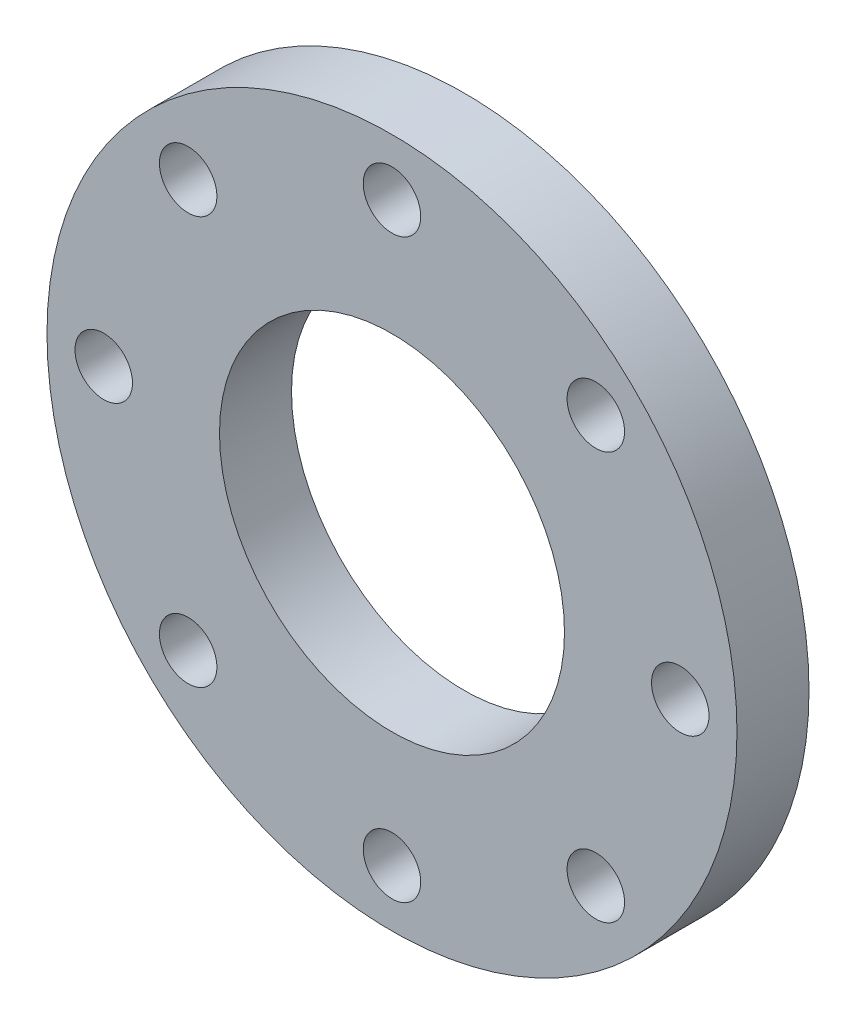
ISO-10303-21;
HEADER;
FILE_DESCRIPTION(('STEP AP214'),'2;1');
FILE_NAME('part.step','',(''),(''),'','','');
FILE_SCHEMA(('AUTOMOTIVE_DESIGN { 1 0 10303 214 1 1 1 1 }'));
ENDSEC;
DATA;
#1=APPLICATION_CONTEXT('core data for automotive mechanical design processes');
#2=APPLICATION_PROTOCOL_DEFINITION('international standard','automotive_design',2000,#1);
#3=PRODUCT_CONTEXT('',#1,'mechanical');
#4=PRODUCT('Part','Part','',(#3));
#5=PRODUCT_RELATED_PRODUCT_CATEGORY('part','',(#4));
#6=PRODUCT_DEFINITION_FORMATION('','',#4);
#7=PRODUCT_DEFINITION_CONTEXT('part definition',#1,'design');
#8=PRODUCT_DEFINITION('design','',#6,#7);
#9=PRODUCT_DEFINITION_SHAPE('','',#8);
#10=(LENGTH_UNIT() NAMED_UNIT(*) SI_UNIT(.MILLI.,.METRE.));
#11=(NAMED_UNIT(*) PLANE_ANGLE_UNIT() SI_UNIT($,.RADIAN.));
#12=(NAMED_UNIT(*) SI_UNIT($,.STERADIAN.) SOLID_ANGLE_UNIT());
#13=UNCERTAINTY_MEASURE_WITH_UNIT(LENGTH_MEASURE(1.E-05),#10,'distance_accuracy_value','');
#14=(GEOMETRIC_REPRESENTATION_CONTEXT(3) GLOBAL_UNCERTAINTY_ASSIGNED_CONTEXT((#13)) GLOBAL_UNIT_ASSIGNED_CONTEXT((#10,
#11,#12)) REPRESENTATION_CONTEXT('',''));
#15=CARTESIAN_POINT('',(0.,0.,0.));
#16=DIRECTION('',(0.,0.,1.));
#17=DIRECTION('',(1.,0.,0.));
#18=AXIS2_PLACEMENT_3D('',#15,#16,#17);
#19=CARTESIAN_POINT('',(0.,0.,23.8));
#20=DIRECTION('',(0.,0.,1.));
#21=DIRECTION('',(1.,0.,0.));
#22=AXIS2_PLACEMENT_3D('',#19,#20,#21);
#23=PLANE('',#22);
#24=CARTESIAN_POINT('',(-95.25,0.,23.8));
#25=DIRECTION('',(0.,0.,1.));
#26=DIRECTION('',(1.,0.,0.));
#27=AXIS2_PLACEMENT_3D('',#24,#25,#26);
#28=CIRCLE('',#27,9.49999999999999);
#29=CARTESIAN_POINT('',(-85.75,0.,23.8));
#30=VERTEX_POINT('',#29);
#31=EDGE_CURVE('E86',#30,#30,#28,.T.);
#32=ORIENTED_EDGE('',*,*,#31,.F.);
#33=EDGE_LOOP('',(#32));
#34=FACE_BOUND('',#33,.T.);
#35=CARTESIAN_POINT('',(0.,-95.25,23.8));
#36=DIRECTION('',(0.,0.,1.));
#37=DIRECTION('',(1.,0.,0.));
#38=AXIS2_PLACEMENT_3D('',#35,#36,#37);
#39=CIRCLE('',#38,9.49999999999999);
#40=CARTESIAN_POINT('',(9.50000000000001,-95.25,23.8));
#41=VERTEX_POINT('',#40);
#42=EDGE_CURVE('E74',#41,#41,#39,.T.);
#43=ORIENTED_EDGE('',*,*,#42,.F.);
#44=EDGE_LOOP('',(#43));
#45=FACE_BOUND('',#44,.T.);
#46=CARTESIAN_POINT('',(95.25,0.,23.8));
#47=DIRECTION('',(0.,0.,1.));
#48=DIRECTION('',(1.,0.,0.));
#49=AXIS2_PLACEMENT_3D('',#46,#47,#48);
#50=CIRCLE('',#49,9.49999999999999);
#51=CARTESIAN_POINT('',(104.75,0.,23.8));
#52=VERTEX_POINT('',#51);
#53=EDGE_CURVE('E62',#52,#52,#50,.T.);
#54=ORIENTED_EDGE('',*,*,#53,.F.);
#55=EDGE_LOOP('',(#54));
#56=FACE_BOUND('',#55,.T.);
#57=CARTESIAN_POINT('',(0.,95.25,23.8));
#58=DIRECTION('',(0.,0.,1.));
#59=DIRECTION('',(1.,0.,0.));
#60=AXIS2_PLACEMENT_3D('',#57,#58,#59);
#61=CIRCLE('',#60,9.5);
#62=CARTESIAN_POINT('',(9.5,95.25,23.8));
#63=VERTEX_POINT('',#62);
#64=EDGE_CURVE('E50',#63,#63,#61,.T.);
#65=ORIENTED_EDGE('',*,*,#64,.F.);
#66=EDGE_LOOP('',(#65));
#67=FACE_BOUND('',#66,.T.);
#68=CARTESIAN_POINT('',(0.,0.,23.8));
#69=DIRECTION('',(0.,0.,1.));
#70=DIRECTION('',(1.,0.,0.));
#71=AXIS2_PLACEMENT_3D('',#68,#69,#70);
#72=CIRCLE('',#71,114.);
#73=CARTESIAN_POINT('',(114.,0.,23.8));
#74=VERTEX_POINT('',#73);
#75=EDGE_CURVE('E10',#74,#74,#72,.T.);
#76=ORIENTED_EDGE('',*,*,#75,.T.);
#77=EDGE_LOOP('',(#76));
#78=FACE_BOUND('',#77,.T.);
#79=CARTESIAN_POINT('',(0.,0.,23.8));
#80=DIRECTION('',(0.,0.,1.));
#81=DIRECTION('',(1.,0.,0.));
#82=AXIS2_PLACEMENT_3D('',#79,#80,#81);
#83=CIRCLE('',#82,57.);
#84=CARTESIAN_POINT('',(57.,0.,23.8));
#85=VERTEX_POINT('',#84);
#86=EDGE_CURVE('E45',#85,#85,#83,.T.);
#87=ORIENTED_EDGE('',*,*,#86,.F.);
#88=EDGE_LOOP('',(#87));
#89=FACE_BOUND('',#88,.T.);
#90=CARTESIAN_POINT('',(67.3519209080186,67.3519209080186,23.8));
#91=DIRECTION('',(0.,0.,1.));
#92=DIRECTION('',(1.,0.,0.));
#93=AXIS2_PLACEMENT_3D('',#90,#91,#92);
#94=CIRCLE('',#93,9.50000000000001);
#95=CARTESIAN_POINT('',(76.8519209080187,67.3519209080186,23.8));
#96=VERTEX_POINT('',#95);
#97=EDGE_CURVE('E56',#96,#96,#94,.T.);
#98=ORIENTED_EDGE('',*,*,#97,.F.);
#99=EDGE_LOOP('',(#98));
#100=FACE_BOUND('',#99,.T.);
#101=CARTESIAN_POINT('',(67.3519209080186,-67.3519209080186,23.8));
#102=DIRECTION('',(0.,0.,1.));
#103=DIRECTION('',(1.,0.,0.));
#104=AXIS2_PLACEMENT_3D('',#101,#102,#103);
#105=CIRCLE('',#104,9.49999999999999);
#106=CARTESIAN_POINT('',(76.8519209080186,-67.3519209080186,23.8));
#107=VERTEX_POINT('',#106);
#108=EDGE_CURVE('E68',#107,#107,#105,.T.);
#109=ORIENTED_EDGE('',*,*,#108,.F.);
#110=EDGE_LOOP('',(#109));
#111=FACE_BOUND('',#110,.T.);
#112=CARTESIAN_POINT('',(-67.3519209080186,-67.3519209080186,23.8));
#113=DIRECTION('',(0.,0.,1.));
#114=DIRECTION('',(1.,0.,0.));
#115=AXIS2_PLACEMENT_3D('',#112,#113,#114);
#116=CIRCLE('',#115,9.50000000000001);
#117=CARTESIAN_POINT('',(-57.8519209080186,-67.3519209080186,23.8));
#118=VERTEX_POINT('',#117);
#119=EDGE_CURVE('E80',#118,#118,#116,.T.);
#120=ORIENTED_EDGE('',*,*,#119,.F.);
#121=EDGE_LOOP('',(#120));
#122=FACE_BOUND('',#121,.T.);
#123=CARTESIAN_POINT('',(-67.3519209080186,67.3519209080186,23.8));
#124=DIRECTION('',(0.,0.,1.));
#125=DIRECTION('',(1.,0.,0.));
#126=AXIS2_PLACEMENT_3D('',#123,#124,#125);
#127=CIRCLE('',#126,9.49999999999999);
#128=CARTESIAN_POINT('',(-57.8519209080186,67.3519209080186,23.8));
#129=VERTEX_POINT('',#128);
#130=EDGE_CURVE('E92',#129,#129,#127,.T.);
#131=ORIENTED_EDGE('',*,*,#130,.F.);
#132=EDGE_LOOP('',(#131));
#133=FACE_BOUND('',#132,.T.);
#134=ADVANCED_FACE('F34',(#34,#45,#56,#67,#78,#89,#100,#111,#122,#133),#23,.T.);
#135=CARTESIAN_POINT('',(0.,0.,0.));
#136=DIRECTION('',(0.,0.,1.));
#137=DIRECTION('',(1.,0.,0.));
#138=AXIS2_PLACEMENT_3D('',#135,#136,#137);
#139=PLANE('',#138);
#140=CARTESIAN_POINT('',(0.,0.,0.));
#141=DIRECTION('',(0.,0.,1.));
#142=DIRECTION('',(1.,0.,0.));
#143=AXIS2_PLACEMENT_3D('',#140,#141,#142);
#144=CIRCLE('',#143,114.);
#145=CARTESIAN_POINT('',(114.,0.,0.));
#146=VERTEX_POINT('',#145);
#147=EDGE_CURVE('E38',#146,#146,#144,.T.);
#148=ORIENTED_EDGE('',*,*,#147,.F.);
#149=EDGE_LOOP('',(#148));
#150=FACE_BOUND('',#149,.T.);
#151=CARTESIAN_POINT('',(0.,0.,0.));
#152=DIRECTION('',(0.,0.,1.));
#153=DIRECTION('',(1.,0.,0.));
#154=AXIS2_PLACEMENT_3D('',#151,#152,#153);
#155=CIRCLE('',#154,57.);
#156=CARTESIAN_POINT('',(57.,0.,0.));
#157=VERTEX_POINT('',#156);
#158=EDGE_CURVE('E47',#157,#157,#155,.T.);
#159=ORIENTED_EDGE('',*,*,#158,.T.);
#160=EDGE_LOOP('',(#159));
#161=FACE_BOUND('',#160,.T.);
#162=CARTESIAN_POINT('',(0.,95.25,0.));
#163=DIRECTION('',(0.,0.,1.));
#164=DIRECTION('',(1.,0.,0.));
#165=AXIS2_PLACEMENT_3D('',#162,#163,#164);
#166=CIRCLE('',#165,9.5);
#167=CARTESIAN_POINT('',(9.5,95.25,0.));
#168=VERTEX_POINT('',#167);
#169=EDGE_CURVE('E53',#168,#168,#166,.T.);
#170=ORIENTED_EDGE('',*,*,#169,.T.);
#171=EDGE_LOOP('',(#170));
#172=FACE_BOUND('',#171,.T.);
#173=CARTESIAN_POINT('',(67.3519209080186,67.3519209080186,0.));
#174=DIRECTION('',(0.,0.,1.));
#175=DIRECTION('',(1.,0.,0.));
#176=AXIS2_PLACEMENT_3D('',#173,#174,#175);
#177=CIRCLE('',#176,9.50000000000001);
#178=CARTESIAN_POINT('',(76.8519209080187,67.3519209080186,0.));
#179=VERTEX_POINT('',#178);
#180=EDGE_CURVE('E59',#179,#179,#177,.T.);
#181=ORIENTED_EDGE('',*,*,#180,.T.);
#182=EDGE_LOOP('',(#181));
#183=FACE_BOUND('',#182,.T.);
#184=CARTESIAN_POINT('',(95.25,0.,0.));
#185=DIRECTION('',(0.,0.,1.));
#186=DIRECTION('',(1.,0.,0.));
#187=AXIS2_PLACEMENT_3D('',#184,#185,#186);
#188=CIRCLE('',#187,9.49999999999999);
#189=CARTESIAN_POINT('',(104.75,0.,0.));
#190=VERTEX_POINT('',#189);
#191=EDGE_CURVE('E65',#190,#190,#188,.T.);
#192=ORIENTED_EDGE('',*,*,#191,.T.);
#193=EDGE_LOOP('',(#192));
#194=FACE_BOUND('',#193,.T.);
#195=CARTESIAN_POINT('',(67.3519209080186,-67.3519209080186,0.));
#196=DIRECTION('',(0.,0.,1.));
#197=DIRECTION('',(1.,0.,0.));
#198=AXIS2_PLACEMENT_3D('',#195,#196,#197);
#199=CIRCLE('',#198,9.49999999999999);
#200=CARTESIAN_POINT('',(76.8519209080186,-67.3519209080186,0.));
#201=VERTEX_POINT('',#200);
#202=EDGE_CURVE('E71',#201,#201,#199,.T.);
#203=ORIENTED_EDGE('',*,*,#202,.T.);
#204=EDGE_LOOP('',(#203));
#205=FACE_BOUND('',#204,.T.);
#206=CARTESIAN_POINT('',(0.,-95.25,0.));
#207=DIRECTION('',(0.,0.,1.));
#208=DIRECTION('',(1.,0.,0.));
#209=AXIS2_PLACEMENT_3D('',#206,#207,#208);
#210=CIRCLE('',#209,9.49999999999999);
#211=CARTESIAN_POINT('',(9.50000000000001,-95.25,0.));
#212=VERTEX_POINT('',#211);
#213=EDGE_CURVE('E77',#212,#212,#210,.T.);
#214=ORIENTED_EDGE('',*,*,#213,.T.);
#215=EDGE_LOOP('',(#214));
#216=FACE_BOUND('',#215,.T.);
#217=CARTESIAN_POINT('',(-67.3519209080186,-67.3519209080186,0.));
#218=DIRECTION('',(0.,0.,1.));
#219=DIRECTION('',(1.,0.,0.));
#220=AXIS2_PLACEMENT_3D('',#217,#218,#219);
#221=CIRCLE('',#220,9.50000000000001);
#222=CARTESIAN_POINT('',(-57.8519209080186,-67.3519209080186,0.));
#223=VERTEX_POINT('',#222);
#224=EDGE_CURVE('E83',#223,#223,#221,.T.);
#225=ORIENTED_EDGE('',*,*,#224,.T.);
#226=EDGE_LOOP('',(#225));
#227=FACE_BOUND('',#226,.T.);
#228=CARTESIAN_POINT('',(-95.25,0.,0.));
#229=DIRECTION('',(0.,0.,1.));
#230=DIRECTION('',(1.,0.,0.));
#231=AXIS2_PLACEMENT_3D('',#228,#229,#230);
#232=CIRCLE('',#231,9.49999999999999);
#233=CARTESIAN_POINT('',(-85.75,0.,0.));
#234=VERTEX_POINT('',#233);
#235=EDGE_CURVE('E89',#234,#234,#232,.T.);
#236=ORIENTED_EDGE('',*,*,#235,.T.);
#237=EDGE_LOOP('',(#236));
#238=FACE_BOUND('',#237,.T.);
#239=CARTESIAN_POINT('',(-67.3519209080186,67.3519209080186,0.));
#240=DIRECTION('',(0.,0.,1.));
#241=DIRECTION('',(1.,0.,0.));
#242=AXIS2_PLACEMENT_3D('',#239,#240,#241);
#243=CIRCLE('',#242,9.49999999999999);
#244=CARTESIAN_POINT('',(-57.8519209080186,67.3519209080186,0.));
#245=VERTEX_POINT('',#244);
#246=EDGE_CURVE('E95',#245,#245,#243,.T.);
#247=ORIENTED_EDGE('',*,*,#246,.T.);
#248=EDGE_LOOP('',(#247));
#249=FACE_BOUND('',#248,.T.);
#250=ADVANCED_FACE('F105',(#150,#161,#172,#183,#194,#205,#216,#227,#238,#249),#139,.F.);
#251=CARTESIAN_POINT('',(0.,0.,23.8));
#252=DIRECTION('',(0.,0.,-1.));
#253=DIRECTION('',(-1.,0.,0.));
#254=AXIS2_PLACEMENT_3D('',#251,#252,#253);
#255=CYLINDRICAL_SURFACE('',#254,114.);
#256=ORIENTED_EDGE('',*,*,#75,.F.);
#257=EDGE_LOOP('',(#256));
#258=FACE_BOUND('',#257,.T.);
#259=ORIENTED_EDGE('',*,*,#147,.T.);
#260=EDGE_LOOP('',(#259));
#261=FACE_BOUND('',#260,.T.);
#262=ADVANCED_FACE('F36',(#258,#261),#255,.T.);
#263=CARTESIAN_POINT('',(0.,0.,23.8));
#264=DIRECTION('',(0.,0.,-1.));
#265=DIRECTION('',(-1.,0.,0.));
#266=AXIS2_PLACEMENT_3D('',#263,#264,#265);
#267=CYLINDRICAL_SURFACE('',#266,57.);
#268=ORIENTED_EDGE('',*,*,#86,.T.);
#269=EDGE_LOOP('',(#268));
#270=FACE_BOUND('',#269,.T.);
#271=ORIENTED_EDGE('',*,*,#158,.F.);
#272=EDGE_LOOP('',(#271));
#273=FACE_BOUND('',#272,.T.);
#274=ADVANCED_FACE('F115',(#270,#273),#267,.F.);
#275=CARTESIAN_POINT('',(0.,95.25,23.8));
#276=DIRECTION('',(0.,0.,-1.));
#277=DIRECTION('',(-1.,0.,0.));
#278=AXIS2_PLACEMENT_3D('',#275,#276,#277);
#279=CYLINDRICAL_SURFACE('',#278,9.5);
#280=ORIENTED_EDGE('',*,*,#64,.T.);
#281=EDGE_LOOP('',(#280));
#282=FACE_BOUND('',#281,.T.);
#283=ORIENTED_EDGE('',*,*,#169,.F.);
#284=EDGE_LOOP('',(#283));
#285=FACE_BOUND('',#284,.T.);
#286=ADVANCED_FACE('F118',(#282,#285),#279,.F.);
#287=CARTESIAN_POINT('',(67.3519209080186,67.3519209080186,23.8));
#288=DIRECTION('',(0.,0.,-1.));
#289=DIRECTION('',(-1.,0.,0.));
#290=AXIS2_PLACEMENT_3D('',#287,#288,#289);
#291=CYLINDRICAL_SURFACE('',#290,9.50000000000001);
#292=ORIENTED_EDGE('',*,*,#97,.T.);
#293=EDGE_LOOP('',(#292));
#294=FACE_BOUND('',#293,.T.);
#295=ORIENTED_EDGE('',*,*,#180,.F.);
#296=EDGE_LOOP('',(#295));
#297=FACE_BOUND('',#296,.T.);
#298=ADVANCED_FACE('F122',(#294,#297),#291,.F.);
#299=CARTESIAN_POINT('',(95.25,0.,23.8));
#300=DIRECTION('',(0.,0.,-1.));
#301=DIRECTION('',(-1.,0.,0.));
#302=AXIS2_PLACEMENT_3D('',#299,#300,#301);
#303=CYLINDRICAL_SURFACE('',#302,9.49999999999999);
#304=ORIENTED_EDGE('',*,*,#53,.T.);
#305=EDGE_LOOP('',(#304));
#306=FACE_BOUND('',#305,.T.);
#307=ORIENTED_EDGE('',*,*,#191,.F.);
#308=EDGE_LOOP('',(#307));
#309=FACE_BOUND('',#308,.T.);
#310=ADVANCED_FACE('F126',(#306,#309),#303,.F.);
#311=CARTESIAN_POINT('',(67.3519209080186,-67.3519209080186,23.8));
#312=DIRECTION('',(0.,0.,-1.));
#313=DIRECTION('',(-1.,0.,0.));
#314=AXIS2_PLACEMENT_3D('',#311,#312,#313);
#315=CYLINDRICAL_SURFACE('',#314,9.49999999999999);
#316=ORIENTED_EDGE('',*,*,#108,.T.);
#317=EDGE_LOOP('',(#316));
#318=FACE_BOUND('',#317,.T.);
#319=ORIENTED_EDGE('',*,*,#202,.F.);
#320=EDGE_LOOP('',(#319));
#321=FACE_BOUND('',#320,.T.);
#322=ADVANCED_FACE('F130',(#318,#321),#315,.F.);
#323=CARTESIAN_POINT('',(0.,-95.25,23.8));
#324=DIRECTION('',(0.,0.,-1.));
#325=DIRECTION('',(-1.,0.,0.));
#326=AXIS2_PLACEMENT_3D('',#323,#324,#325);
#327=CYLINDRICAL_SURFACE('',#326,9.49999999999999);
#328=ORIENTED_EDGE('',*,*,#42,.T.);
#329=EDGE_LOOP('',(#328));
#330=FACE_BOUND('',#329,.T.);
#331=ORIENTED_EDGE('',*,*,#213,.F.);
#332=EDGE_LOOP('',(#331));
#333=FACE_BOUND('',#332,.T.);
#334=ADVANCED_FACE('F134',(#330,#333),#327,.F.);
#335=CARTESIAN_POINT('',(-67.3519209080186,-67.3519209080186,23.8));
#336=DIRECTION('',(0.,0.,-1.));
#337=DIRECTION('',(-1.,0.,0.));
#338=AXIS2_PLACEMENT_3D('',#335,#336,#337);
#339=CYLINDRICAL_SURFACE('',#338,9.50000000000001);
#340=ORIENTED_EDGE('',*,*,#119,.T.);
#341=EDGE_LOOP('',(#340));
#342=FACE_BOUND('',#341,.T.);
#343=ORIENTED_EDGE('',*,*,#224,.F.);
#344=EDGE_LOOP('',(#343));
#345=FACE_BOUND('',#344,.T.);
#346=ADVANCED_FACE('F138',(#342,#345),#339,.F.);
#347=CARTESIAN_POINT('',(-95.25,0.,23.8));
#348=DIRECTION('',(0.,0.,-1.));
#349=DIRECTION('',(-1.,0.,0.));
#350=AXIS2_PLACEMENT_3D('',#347,#348,#349);
#351=CYLINDRICAL_SURFACE('',#350,9.49999999999999);
#352=ORIENTED_EDGE('',*,*,#31,.T.);
#353=EDGE_LOOP('',(#352));
#354=FACE_BOUND('',#353,.T.);
#355=ORIENTED_EDGE('',*,*,#235,.F.);
#356=EDGE_LOOP('',(#355));
#357=FACE_BOUND('',#356,.T.);
#358=ADVANCED_FACE('F142',(#354,#357),#351,.F.);
#359=CARTESIAN_POINT('',(-67.3519209080186,67.3519209080186,23.8));
#360=DIRECTION('',(0.,0.,-1.));
#361=DIRECTION('',(-1.,0.,0.));
#362=AXIS2_PLACEMENT_3D('',#359,#360,#361);
#363=CYLINDRICAL_SURFACE('',#362,9.49999999999999);
#364=ORIENTED_EDGE('',*,*,#130,.T.);
#365=EDGE_LOOP('',(#364));
#366=FACE_BOUND('',#365,.T.);
#367=ORIENTED_EDGE('',*,*,#246,.F.);
#368=EDGE_LOOP('',(#367));
#369=FACE_BOUND('',#368,.T.);
#370=ADVANCED_FACE('F101',(#366,#369),#363,.F.);
#371=CLOSED_SHELL('',(#134,#250,#262,#274,#286,#298,#310,#322,#334,#346,#358,#370));
#372=MANIFOLD_SOLID_BREP('B2',#371);
#373=ADVANCED_BREP_SHAPE_REPRESENTATION('',(#18,#372),#14);
#374=SHAPE_DEFINITION_REPRESENTATION(#9,#373);
ENDSEC;
END-ISO-10303-21;
